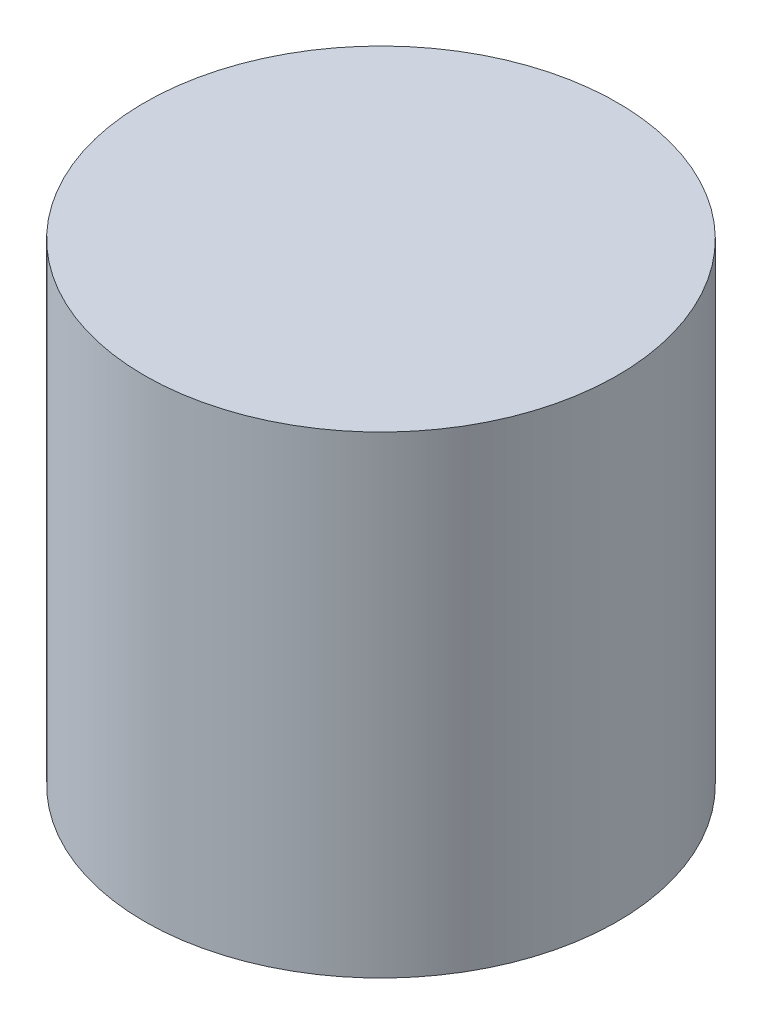
ISO-10303-21;
HEADER;
FILE_DESCRIPTION(('STEP AP214'),'2;1');
FILE_NAME('part.step','',(''),(''),'','','');
FILE_SCHEMA(('AUTOMOTIVE_DESIGN { 1 0 10303 214 1 1 1 1 }'));
ENDSEC;
DATA;
#1=APPLICATION_CONTEXT('core data for automotive mechanical design processes');
#2=APPLICATION_PROTOCOL_DEFINITION('international standard','automotive_design',2000,#1);
#3=PRODUCT_CONTEXT('',#1,'mechanical');
#4=PRODUCT('Part','Part','',(#3));
#5=PRODUCT_RELATED_PRODUCT_CATEGORY('part','',(#4));
#6=PRODUCT_DEFINITION_FORMATION('','',#4);
#7=PRODUCT_DEFINITION_CONTEXT('part definition',#1,'design');
#8=PRODUCT_DEFINITION('design','',#6,#7);
#9=PRODUCT_DEFINITION_SHAPE('','',#8);
#10=(LENGTH_UNIT() NAMED_UNIT(*) SI_UNIT(.MILLI.,.METRE.));
#11=(NAMED_UNIT(*) PLANE_ANGLE_UNIT() SI_UNIT($,.RADIAN.));
#12=(NAMED_UNIT(*) SI_UNIT($,.STERADIAN.) SOLID_ANGLE_UNIT());
#13=UNCERTAINTY_MEASURE_WITH_UNIT(LENGTH_MEASURE(1.E-05),#10,'distance_accuracy_value','');
#14=(GEOMETRIC_REPRESENTATION_CONTEXT(3) GLOBAL_UNCERTAINTY_ASSIGNED_CONTEXT((#13)) GLOBAL_UNIT_ASSIGNED_CONTEXT((#10,
#11,#12)) REPRESENTATION_CONTEXT('',''));
#15=CARTESIAN_POINT('',(0.,0.,0.));
#16=DIRECTION('',(0.,0.,1.));
#17=DIRECTION('',(1.,0.,0.));
#18=AXIS2_PLACEMENT_3D('',#15,#16,#17);
#19=CARTESIAN_POINT('',(0.,152.4,0.));
#20=DIRECTION('',(0.,-1.,0.));
#21=DIRECTION('',(0.,0.,-1.));
#22=AXIS2_PLACEMENT_3D('',#19,#20,#21);
#23=CYLINDRICAL_SURFACE('',#22,76.2);
#24=CARTESIAN_POINT('',(0.,152.4,0.));
#25=DIRECTION('',(0.,1.,0.));
#26=DIRECTION('',(0.,0.,1.));
#27=AXIS2_PLACEMENT_3D('',#24,#25,#26);
#28=CIRCLE('',#27,76.2);
#29=CARTESIAN_POINT('',(0.,152.4,76.2));
#30=VERTEX_POINT('',#29);
#31=EDGE_CURVE('E10',#30,#30,#28,.T.);
#32=ORIENTED_EDGE('',*,*,#31,.F.);
#33=EDGE_LOOP('',(#32));
#34=FACE_BOUND('',#33,.T.);
#35=CARTESIAN_POINT('',(0.,0.,0.));
#36=DIRECTION('',(0.,1.,0.));
#37=DIRECTION('',(0.,0.,1.));
#38=AXIS2_PLACEMENT_3D('',#35,#36,#37);
#39=CIRCLE('',#38,76.2);
#40=CARTESIAN_POINT('',(0.,0.,76.2));
#41=VERTEX_POINT('',#40);
#42=EDGE_CURVE('E40',#41,#41,#39,.T.);
#43=ORIENTED_EDGE('',*,*,#42,.T.);
#44=EDGE_LOOP('',(#43));
#45=FACE_BOUND('',#44,.T.);
#46=ADVANCED_FACE('F37',(#34,#45),#23,.T.);
#47=CARTESIAN_POINT('',(0.,152.4,0.));
#48=DIRECTION('',(0.,1.,0.));
#49=DIRECTION('',(0.,0.,1.));
#50=AXIS2_PLACEMENT_3D('',#47,#48,#49);
#51=PLANE('',#50);
#52=ORIENTED_EDGE('',*,*,#31,.T.);
#53=EDGE_LOOP('',(#52));
#54=FACE_BOUND('',#53,.T.);
#55=ADVANCED_FACE('F52',(#54),#51,.T.);
#56=CARTESIAN_POINT('',(0.,0.,0.));
#57=DIRECTION('',(0.,1.,0.));
#58=DIRECTION('',(0.,0.,1.));
#59=AXIS2_PLACEMENT_3D('',#56,#57,#58);
#60=PLANE('',#59);
#61=ORIENTED_EDGE('',*,*,#42,.F.);
#62=EDGE_LOOP('',(#61));
#63=FACE_BOUND('',#62,.T.);
#64=ADVANCED_FACE('F50',(#63),#60,.F.);
#65=CLOSED_SHELL('',(#46,#55,#64));
#66=MANIFOLD_SOLID_BREP('B2',#65);
#67=ADVANCED_BREP_SHAPE_REPRESENTATION('',(#18,#66),#14);
#68=SHAPE_DEFINITION_REPRESENTATION(#9,#67);
ENDSEC;
END-ISO-10303-21;
